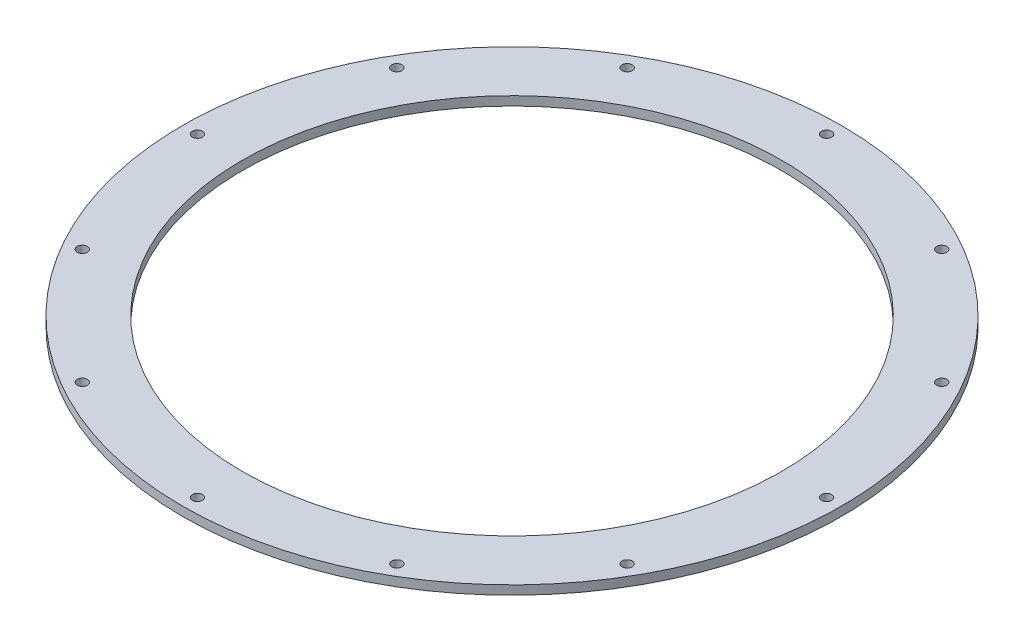
ISO-10303-21;
HEADER;
FILE_DESCRIPTION(('STEP AP214'),'2;1');
FILE_NAME('part.step','',(''),(''),'','','');
FILE_SCHEMA(('AUTOMOTIVE_DESIGN { 1 0 10303 214 1 1 1 1 }'));
ENDSEC;
DATA;
#1=APPLICATION_CONTEXT('core data for automotive mechanical design processes');
#2=APPLICATION_PROTOCOL_DEFINITION('international standard','automotive_design',2000,#1);
#3=PRODUCT_CONTEXT('',#1,'mechanical');
#4=PRODUCT('Part','Part','',(#3));
#5=PRODUCT_RELATED_PRODUCT_CATEGORY('part','',(#4));
#6=PRODUCT_DEFINITION_FORMATION('','',#4);
#7=PRODUCT_DEFINITION_CONTEXT('part definition',#1,'design');
#8=PRODUCT_DEFINITION('design','',#6,#7);
#9=PRODUCT_DEFINITION_SHAPE('','',#8);
#10=(LENGTH_UNIT() NAMED_UNIT(*) SI_UNIT(.MILLI.,.METRE.));
#11=(NAMED_UNIT(*) PLANE_ANGLE_UNIT() SI_UNIT($,.RADIAN.));
#12=(NAMED_UNIT(*) SI_UNIT($,.STERADIAN.) SOLID_ANGLE_UNIT());
#13=UNCERTAINTY_MEASURE_WITH_UNIT(LENGTH_MEASURE(1.E-05),#10,'distance_accuracy_value','');
#14=(GEOMETRIC_REPRESENTATION_CONTEXT(3) GLOBAL_UNCERTAINTY_ASSIGNED_CONTEXT((#13)) GLOBAL_UNIT_ASSIGNED_CONTEXT((#10,
#11,#12)) REPRESENTATION_CONTEXT('',''));
#15=CARTESIAN_POINT('',(0.,0.,0.));
#16=DIRECTION('',(0.,0.,1.));
#17=DIRECTION('',(1.,0.,0.));
#18=AXIS2_PLACEMENT_3D('',#15,#16,#17);
#19=CARTESIAN_POINT('',(0.,3.,0.));
#20=DIRECTION('',(0.,-1.,0.));
#21=DIRECTION('',(0.,0.,-1.));
#22=AXIS2_PLACEMENT_3D('',#19,#20,#21);
#23=CYLINDRICAL_SURFACE('',#22,90.);
#24=CARTESIAN_POINT('',(0.,3.,0.));
#25=DIRECTION('',(0.,1.,0.));
#26=DIRECTION('',(0.,0.,1.));
#27=AXIS2_PLACEMENT_3D('',#24,#25,#26);
#28=CIRCLE('',#27,90.);
#29=CARTESIAN_POINT('',(0.,3.,90.));
#30=VERTEX_POINT('',#29);
#31=EDGE_CURVE('E41',#30,#30,#28,.T.);
#32=ORIENTED_EDGE('',*,*,#31,.T.);
#33=EDGE_LOOP('',(#32));
#34=FACE_BOUND('',#33,.T.);
#35=CARTESIAN_POINT('',(0.,0.,0.));
#36=DIRECTION('',(0.,1.,0.));
#37=DIRECTION('',(0.,0.,1.));
#38=AXIS2_PLACEMENT_3D('',#35,#36,#37);
#39=CIRCLE('',#38,90.);
#40=CARTESIAN_POINT('',(0.,0.,90.));
#41=VERTEX_POINT('',#40);
#42=EDGE_CURVE('E85',#41,#41,#39,.T.);
#43=ORIENTED_EDGE('',*,*,#42,.F.);
#44=EDGE_LOOP('',(#43));
#45=FACE_BOUND('',#44,.T.);
#46=ADVANCED_FACE('F33',(#34,#45),#23,.F.);
#47=CARTESIAN_POINT('',(0.,3.,-105.));
#48=DIRECTION('',(0.,-1.,0.));
#49=DIRECTION('',(0.,0.,-1.));
#50=AXIS2_PLACEMENT_3D('',#47,#48,#49);
#51=CYLINDRICAL_SURFACE('',#50,1.70000000000001);
#52=CARTESIAN_POINT('',(0.,3.,-105.));
#53=DIRECTION('',(0.,1.,0.));
#54=DIRECTION('',(0.,0.,1.));
#55=AXIS2_PLACEMENT_3D('',#52,#53,#54);
#56=CIRCLE('',#55,1.70000000000001);
#57=CARTESIAN_POINT('',(0.,3.,-103.3));
#58=VERTEX_POINT('',#57);
#59=EDGE_CURVE('E46',#58,#58,#56,.T.);
#60=ORIENTED_EDGE('',*,*,#59,.T.);
#61=EDGE_LOOP('',(#60));
#62=FACE_BOUND('',#61,.T.);
#63=CARTESIAN_POINT('',(0.,0.,-105.));
#64=DIRECTION('',(0.,1.,0.));
#65=DIRECTION('',(0.,0.,1.));
#66=AXIS2_PLACEMENT_3D('',#63,#64,#65);
#67=CIRCLE('',#66,1.70000000000001);
#68=CARTESIAN_POINT('',(0.,0.,-103.3));
#69=VERTEX_POINT('',#68);
#70=EDGE_CURVE('E83',#69,#69,#67,.T.);
#71=ORIENTED_EDGE('',*,*,#70,.F.);
#72=EDGE_LOOP('',(#71));
#73=FACE_BOUND('',#72,.T.);
#74=ADVANCED_FACE('F130',(#62,#73),#51,.F.);
#75=CARTESIAN_POINT('',(52.5000000000005,3.,-90.9326673973678));
#76=DIRECTION('',(0.,-1.,0.));
#77=DIRECTION('',(0.,0.,-1.));
#78=AXIS2_PLACEMENT_3D('',#75,#76,#77);
#79=CYLINDRICAL_SURFACE('',#78,1.7);
#80=CARTESIAN_POINT('',(52.5000000000005,3.,-90.9326673973678));
#81=DIRECTION('',(0.,1.,0.));
#82=DIRECTION('',(0.,0.,1.));
#83=AXIS2_PLACEMENT_3D('',#80,#81,#82);
#84=CIRCLE('',#83,1.7);
#85=CARTESIAN_POINT('',(52.5000000000005,3.,-89.2326673973678));
#86=VERTEX_POINT('',#85);
#87=EDGE_CURVE('E125',#86,#86,#84,.T.);
#88=ORIENTED_EDGE('',*,*,#87,.T.);
#89=EDGE_LOOP('',(#88));
#90=FACE_BOUND('',#89,.T.);
#91=CARTESIAN_POINT('',(52.5000000000005,0.,-90.9326673973678));
#92=DIRECTION('',(0.,1.,0.));
#93=DIRECTION('',(0.,0.,1.));
#94=AXIS2_PLACEMENT_3D('',#91,#92,#93);
#95=CIRCLE('',#94,1.7);
#96=CARTESIAN_POINT('',(52.5000000000005,0.,-89.2326673973678));
#97=VERTEX_POINT('',#96);
#98=EDGE_CURVE('E80',#97,#97,#95,.T.);
#99=ORIENTED_EDGE('',*,*,#98,.F.);
#100=EDGE_LOOP('',(#99));
#101=FACE_BOUND('',#100,.T.);
#102=ADVANCED_FACE('F148',(#90,#101),#79,.F.);
#103=CARTESIAN_POINT('',(90.9326673973678,3.,-52.5000000000031));
#104=DIRECTION('',(0.,-1.,0.));
#105=DIRECTION('',(0.,0.,-1.));
#106=AXIS2_PLACEMENT_3D('',#103,#104,#105);
#107=CYLINDRICAL_SURFACE('',#106,1.7);
#108=CARTESIAN_POINT('',(90.9326673973678,3.,-52.5000000000031));
#109=DIRECTION('',(0.,1.,0.));
#110=DIRECTION('',(0.,0.,1.));
#111=AXIS2_PLACEMENT_3D('',#108,#109,#110);
#112=CIRCLE('',#111,1.7);
#113=CARTESIAN_POINT('',(90.9326673973678,3.,-50.8000000000031));
#114=VERTEX_POINT('',#113);
#115=EDGE_CURVE('E122',#114,#114,#112,.T.);
#116=ORIENTED_EDGE('',*,*,#115,.T.);
#117=EDGE_LOOP('',(#116));
#118=FACE_BOUND('',#117,.T.);
#119=CARTESIAN_POINT('',(90.9326673973678,0.,-52.5000000000031));
#120=DIRECTION('',(0.,1.,0.));
#121=DIRECTION('',(0.,0.,1.));
#122=AXIS2_PLACEMENT_3D('',#119,#120,#121);
#123=CIRCLE('',#122,1.7);
#124=CARTESIAN_POINT('',(90.9326673973678,0.,-50.8000000000031));
#125=VERTEX_POINT('',#124);
#126=EDGE_CURVE('E77',#125,#125,#123,.T.);
#127=ORIENTED_EDGE('',*,*,#126,.F.);
#128=EDGE_LOOP('',(#127));
#129=FACE_BOUND('',#128,.T.);
#130=ADVANCED_FACE('F155',(#118,#129),#107,.F.);
#131=CARTESIAN_POINT('',(105.000000000004,3.,-3.60937835248653E-12));
#132=DIRECTION('',(0.,-1.,0.));
#133=DIRECTION('',(0.,0.,-1.));
#134=AXIS2_PLACEMENT_3D('',#131,#132,#133);
#135=CYLINDRICAL_SURFACE('',#134,1.7);
#136=CARTESIAN_POINT('',(105.000000000004,3.,-3.60937835248653E-12));
#137=DIRECTION('',(0.,1.,0.));
#138=DIRECTION('',(0.,0.,1.));
#139=AXIS2_PLACEMENT_3D('',#136,#137,#138);
#140=CIRCLE('',#139,1.7);
#141=CARTESIAN_POINT('',(105.000000000004,3.,1.69999999999639));
#142=VERTEX_POINT('',#141);
#143=EDGE_CURVE('E119',#142,#142,#140,.T.);
#144=ORIENTED_EDGE('',*,*,#143,.T.);
#145=EDGE_LOOP('',(#144));
#146=FACE_BOUND('',#145,.T.);
#147=CARTESIAN_POINT('',(105.000000000004,0.,-3.60937835248653E-12));
#148=DIRECTION('',(0.,1.,0.));
#149=DIRECTION('',(0.,0.,1.));
#150=AXIS2_PLACEMENT_3D('',#147,#148,#149);
#151=CIRCLE('',#150,1.7);
#152=CARTESIAN_POINT('',(105.000000000004,0.,1.69999999999639));
#153=VERTEX_POINT('',#152);
#154=EDGE_CURVE('E74',#153,#153,#151,.T.);
#155=ORIENTED_EDGE('',*,*,#154,.F.);
#156=EDGE_LOOP('',(#155));
#157=FACE_BOUND('',#156,.T.);
#158=ADVANCED_FACE('F159',(#146,#157),#135,.F.);
#159=CARTESIAN_POINT('',(90.9326673973715,3.,52.4999999999969));
#160=DIRECTION('',(0.,-1.,0.));
#161=DIRECTION('',(0.,0.,-1.));
#162=AXIS2_PLACEMENT_3D('',#159,#160,#161);
#163=CYLINDRICAL_SURFACE('',#162,1.7);
#164=CARTESIAN_POINT('',(90.9326673973715,3.,52.4999999999969));
#165=DIRECTION('',(0.,1.,0.));
#166=DIRECTION('',(0.,0.,1.));
#167=AXIS2_PLACEMENT_3D('',#164,#165,#166);
#168=CIRCLE('',#167,1.7);
#169=CARTESIAN_POINT('',(90.9326673973715,3.,54.1999999999969));
#170=VERTEX_POINT('',#169);
#171=EDGE_CURVE('E116',#170,#170,#168,.T.);
#172=ORIENTED_EDGE('',*,*,#171,.T.);
#173=EDGE_LOOP('',(#172));
#174=FACE_BOUND('',#173,.T.);
#175=CARTESIAN_POINT('',(90.9326673973715,0.,52.4999999999969));
#176=DIRECTION('',(0.,1.,0.));
#177=DIRECTION('',(0.,0.,1.));
#178=AXIS2_PLACEMENT_3D('',#175,#176,#177);
#179=CIRCLE('',#178,1.7);
#180=CARTESIAN_POINT('',(90.9326673973715,0.,54.1999999999969));
#181=VERTEX_POINT('',#180);
#182=EDGE_CURVE('E71',#181,#181,#179,.T.);
#183=ORIENTED_EDGE('',*,*,#182,.F.);
#184=EDGE_LOOP('',(#183));
#185=FACE_BOUND('',#184,.T.);
#186=ADVANCED_FACE('F163',(#174,#185),#163,.F.);
#187=CARTESIAN_POINT('',(52.5000000000068,3.,90.9326673973642));
#188=DIRECTION('',(0.,-1.,0.));
#189=DIRECTION('',(0.,0.,-1.));
#190=AXIS2_PLACEMENT_3D('',#187,#188,#189);
#191=CYLINDRICAL_SURFACE('',#190,1.7);
#192=CARTESIAN_POINT('',(52.5000000000068,3.,90.9326673973642));
#193=DIRECTION('',(0.,1.,0.));
#194=DIRECTION('',(0.,0.,1.));
#195=AXIS2_PLACEMENT_3D('',#192,#193,#194);
#196=CIRCLE('',#195,1.7);
#197=CARTESIAN_POINT('',(52.5000000000068,3.,92.6326673973643));
#198=VERTEX_POINT('',#197);
#199=EDGE_CURVE('E113',#198,#198,#196,.T.);
#200=ORIENTED_EDGE('',*,*,#199,.T.);
#201=EDGE_LOOP('',(#200));
#202=FACE_BOUND('',#201,.T.);
#203=CARTESIAN_POINT('',(52.5000000000068,0.,90.9326673973642));
#204=DIRECTION('',(0.,1.,0.));
#205=DIRECTION('',(0.,0.,1.));
#206=AXIS2_PLACEMENT_3D('',#203,#204,#205);
#207=CIRCLE('',#206,1.7);
#208=CARTESIAN_POINT('',(52.5000000000068,0.,92.6326673973643));
#209=VERTEX_POINT('',#208);
#210=EDGE_CURVE('E68',#209,#209,#207,.T.);
#211=ORIENTED_EDGE('',*,*,#210,.F.);
#212=EDGE_LOOP('',(#211));
#213=FACE_BOUND('',#212,.T.);
#214=ADVANCED_FACE('F167',(#202,#213),#191,.F.);
#215=CARTESIAN_POINT('',(7.21875670497306E-12,3.,105.));
#216=DIRECTION('',(0.,-1.,0.));
#217=DIRECTION('',(0.,0.,-1.));
#218=AXIS2_PLACEMENT_3D('',#215,#216,#217);
#219=CYLINDRICAL_SURFACE('',#218,1.69999999999999);
#220=CARTESIAN_POINT('',(7.21875670497306E-12,3.,105.));
#221=DIRECTION('',(0.,1.,0.));
#222=DIRECTION('',(0.,0.,1.));
#223=AXIS2_PLACEMENT_3D('',#220,#221,#222);
#224=CIRCLE('',#223,1.69999999999999);
#225=CARTESIAN_POINT('',(7.21875670497306E-12,3.,106.7));
#226=VERTEX_POINT('',#225);
#227=EDGE_CURVE('E110',#226,#226,#224,.T.);
#228=ORIENTED_EDGE('',*,*,#227,.T.);
#229=EDGE_LOOP('',(#228));
#230=FACE_BOUND('',#229,.T.);
#231=CARTESIAN_POINT('',(7.21875670497306E-12,0.,105.));
#232=DIRECTION('',(0.,1.,0.));
#233=DIRECTION('',(0.,0.,1.));
#234=AXIS2_PLACEMENT_3D('',#231,#232,#233);
#235=CIRCLE('',#234,1.69999999999999);
#236=CARTESIAN_POINT('',(7.21875670497306E-12,0.,106.7));
#237=VERTEX_POINT('',#236);
#238=EDGE_CURVE('E65',#237,#237,#235,.T.);
#239=ORIENTED_EDGE('',*,*,#238,.F.);
#240=EDGE_LOOP('',(#239));
#241=FACE_BOUND('',#240,.T.);
#242=ADVANCED_FACE('F171',(#230,#241),#219,.F.);
#243=CARTESIAN_POINT('',(-52.4999999999932,3.,90.9326673973679));
#244=DIRECTION('',(0.,-1.,0.));
#245=DIRECTION('',(0.,0.,-1.));
#246=AXIS2_PLACEMENT_3D('',#243,#244,#245);
#247=CYLINDRICAL_SURFACE('',#246,1.7);
#248=CARTESIAN_POINT('',(-52.4999999999932,3.,90.9326673973679));
#249=DIRECTION('',(0.,1.,0.));
#250=DIRECTION('',(0.,0.,1.));
#251=AXIS2_PLACEMENT_3D('',#248,#249,#250);
#252=CIRCLE('',#251,1.7);
#253=CARTESIAN_POINT('',(-52.4999999999932,3.,92.6326673973679));
#254=VERTEX_POINT('',#253);
#255=EDGE_CURVE('E107',#254,#254,#252,.T.);
#256=ORIENTED_EDGE('',*,*,#255,.T.);
#257=EDGE_LOOP('',(#256));
#258=FACE_BOUND('',#257,.T.);
#259=CARTESIAN_POINT('',(-52.4999999999932,0.,90.9326673973679));
#260=DIRECTION('',(0.,1.,0.));
#261=DIRECTION('',(0.,0.,1.));
#262=AXIS2_PLACEMENT_3D('',#259,#260,#261);
#263=CIRCLE('',#262,1.7);
#264=CARTESIAN_POINT('',(-52.4999999999932,0.,92.6326673973679));
#265=VERTEX_POINT('',#264);
#266=EDGE_CURVE('E62',#265,#265,#263,.T.);
#267=ORIENTED_EDGE('',*,*,#266,.F.);
#268=EDGE_LOOP('',(#267));
#269=FACE_BOUND('',#268,.T.);
#270=ADVANCED_FACE('F175',(#258,#269),#247,.F.);
#271=CARTESIAN_POINT('',(-90.9326673973606,3.,52.5000000000032));
#272=DIRECTION('',(0.,-1.,0.));
#273=DIRECTION('',(0.,0.,-1.));
#274=AXIS2_PLACEMENT_3D('',#271,#272,#273);
#275=CYLINDRICAL_SURFACE('',#274,1.7);
#276=CARTESIAN_POINT('',(-90.9326673973606,3.,52.5000000000032));
#277=DIRECTION('',(0.,1.,0.));
#278=DIRECTION('',(0.,0.,1.));
#279=AXIS2_PLACEMENT_3D('',#276,#277,#278);
#280=CIRCLE('',#279,1.7);
#281=CARTESIAN_POINT('',(-90.9326673973606,3.,54.2000000000032));
#282=VERTEX_POINT('',#281);
#283=EDGE_CURVE('E104',#282,#282,#280,.T.);
#284=ORIENTED_EDGE('',*,*,#283,.T.);
#285=EDGE_LOOP('',(#284));
#286=FACE_BOUND('',#285,.T.);
#287=CARTESIAN_POINT('',(-90.9326673973606,0.,52.5000000000032));
#288=DIRECTION('',(0.,1.,0.));
#289=DIRECTION('',(0.,0.,1.));
#290=AXIS2_PLACEMENT_3D('',#287,#288,#289);
#291=CIRCLE('',#290,1.7);
#292=CARTESIAN_POINT('',(-90.9326673973606,0.,54.2000000000032));
#293=VERTEX_POINT('',#292);
#294=EDGE_CURVE('E59',#293,#293,#291,.T.);
#295=ORIENTED_EDGE('',*,*,#294,.F.);
#296=EDGE_LOOP('',(#295));
#297=FACE_BOUND('',#296,.T.);
#298=ADVANCED_FACE('F179',(#286,#297),#275,.F.);
#299=CARTESIAN_POINT('',(-104.999999999996,3.,3.62223714387758E-12));
#300=DIRECTION('',(0.,-1.,0.));
#301=DIRECTION('',(0.,0.,-1.));
#302=AXIS2_PLACEMENT_3D('',#299,#300,#301);
#303=CYLINDRICAL_SURFACE('',#302,1.7);
#304=CARTESIAN_POINT('',(-104.999999999996,3.,3.62223714387758E-12));
#305=DIRECTION('',(0.,1.,0.));
#306=DIRECTION('',(0.,0.,1.));
#307=AXIS2_PLACEMENT_3D('',#304,#305,#306);
#308=CIRCLE('',#307,1.7);
#309=CARTESIAN_POINT('',(-104.999999999996,3.,1.70000000000362));
#310=VERTEX_POINT('',#309);
#311=EDGE_CURVE('E99',#310,#310,#308,.T.);
#312=ORIENTED_EDGE('',*,*,#311,.T.);
#313=EDGE_LOOP('',(#312));
#314=FACE_BOUND('',#313,.T.);
#315=CARTESIAN_POINT('',(-104.999999999996,0.,3.62223714387758E-12));
#316=DIRECTION('',(0.,1.,0.));
#317=DIRECTION('',(0.,0.,1.));
#318=AXIS2_PLACEMENT_3D('',#315,#316,#317);
#319=CIRCLE('',#318,1.7);
#320=CARTESIAN_POINT('',(-104.999999999996,0.,1.70000000000362));
#321=VERTEX_POINT('',#320);
#322=EDGE_CURVE('E56',#321,#321,#319,.T.);
#323=ORIENTED_EDGE('',*,*,#322,.F.);
#324=EDGE_LOOP('',(#323));
#325=FACE_BOUND('',#324,.T.);
#326=ADVANCED_FACE('F183',(#314,#325),#303,.F.);
#327=CARTESIAN_POINT('',(-90.9326673973643,3.,-52.4999999999968));
#328=DIRECTION('',(0.,-1.,0.));
#329=DIRECTION('',(0.,0.,-1.));
#330=AXIS2_PLACEMENT_3D('',#327,#328,#329);
#331=CYLINDRICAL_SURFACE('',#330,1.7);
#332=CARTESIAN_POINT('',(-90.9326673973643,3.,-52.4999999999968));
#333=DIRECTION('',(0.,1.,0.));
#334=DIRECTION('',(0.,0.,1.));
#335=AXIS2_PLACEMENT_3D('',#332,#333,#334);
#336=CIRCLE('',#335,1.7);
#337=CARTESIAN_POINT('',(-90.9326673973643,3.,-50.7999999999968));
#338=VERTEX_POINT('',#337);
#339=EDGE_CURVE('E94',#338,#338,#336,.T.);
#340=ORIENTED_EDGE('',*,*,#339,.T.);
#341=EDGE_LOOP('',(#340));
#342=FACE_BOUND('',#341,.T.);
#343=CARTESIAN_POINT('',(-90.9326673973643,0.,-52.4999999999968));
#344=DIRECTION('',(0.,1.,0.));
#345=DIRECTION('',(0.,0.,1.));
#346=AXIS2_PLACEMENT_3D('',#343,#344,#345);
#347=CIRCLE('',#346,1.7);
#348=CARTESIAN_POINT('',(-90.9326673973643,0.,-50.7999999999968));
#349=VERTEX_POINT('',#348);
#350=EDGE_CURVE('E53',#349,#349,#347,.T.);
#351=ORIENTED_EDGE('',*,*,#350,.F.);
#352=EDGE_LOOP('',(#351));
#353=FACE_BOUND('',#352,.T.);
#354=ADVANCED_FACE('F186',(#342,#353),#331,.F.);
#355=CARTESIAN_POINT('',(-52.4999999999996,3.,-90.9326673973642));
#356=DIRECTION('',(0.,-1.,0.));
#357=DIRECTION('',(0.,0.,-1.));
#358=AXIS2_PLACEMENT_3D('',#355,#356,#357);
#359=CYLINDRICAL_SURFACE('',#358,1.7);
#360=CARTESIAN_POINT('',(-52.4999999999996,3.,-90.9326673973642));
#361=DIRECTION('',(0.,1.,0.));
#362=DIRECTION('',(0.,0.,1.));
#363=AXIS2_PLACEMENT_3D('',#360,#361,#362);
#364=CIRCLE('',#363,1.7);
#365=CARTESIAN_POINT('',(-52.4999999999996,3.,-89.2326673973642));
#366=VERTEX_POINT('',#365);
#367=EDGE_CURVE('E90',#366,#366,#364,.T.);
#368=ORIENTED_EDGE('',*,*,#367,.T.);
#369=EDGE_LOOP('',(#368));
#370=FACE_BOUND('',#369,.T.);
#371=CARTESIAN_POINT('',(-52.4999999999996,0.,-90.9326673973642));
#372=DIRECTION('',(0.,1.,0.));
#373=DIRECTION('',(0.,0.,1.));
#374=AXIS2_PLACEMENT_3D('',#371,#372,#373);
#375=CIRCLE('',#374,1.7);
#376=CARTESIAN_POINT('',(-52.4999999999996,0.,-89.2326673973642));
#377=VERTEX_POINT('',#376);
#378=EDGE_CURVE('E50',#377,#377,#375,.T.);
#379=ORIENTED_EDGE('',*,*,#378,.F.);
#380=EDGE_LOOP('',(#379));
#381=FACE_BOUND('',#380,.T.);
#382=ADVANCED_FACE('F35',(#370,#381),#359,.F.);
#383=CARTESIAN_POINT('',(0.,3.,0.));
#384=DIRECTION('',(0.,-1.,0.));
#385=DIRECTION('',(0.,0.,-1.));
#386=AXIS2_PLACEMENT_3D('',#383,#384,#385);
#387=CYLINDRICAL_SURFACE('',#386,110.);
#388=CARTESIAN_POINT('',(0.,3.,0.));
#389=DIRECTION('',(0.,1.,0.));
#390=DIRECTION('',(0.,0.,1.));
#391=AXIS2_PLACEMENT_3D('',#388,#389,#390);
#392=CIRCLE('',#391,110.);
#393=CARTESIAN_POINT('',(0.,3.,110.));
#394=VERTEX_POINT('',#393);
#395=EDGE_CURVE('E10',#394,#394,#392,.T.);
#396=ORIENTED_EDGE('',*,*,#395,.F.);
#397=EDGE_LOOP('',(#396));
#398=FACE_BOUND('',#397,.T.);
#399=CARTESIAN_POINT('',(0.,0.,0.));
#400=DIRECTION('',(0.,1.,0.));
#401=DIRECTION('',(0.,0.,1.));
#402=AXIS2_PLACEMENT_3D('',#399,#400,#401);
#403=CIRCLE('',#402,110.);
#404=CARTESIAN_POINT('',(0.,0.,110.));
#405=VERTEX_POINT('',#404);
#406=EDGE_CURVE('E37',#405,#405,#403,.T.);
#407=ORIENTED_EDGE('',*,*,#406,.T.);
#408=EDGE_LOOP('',(#407));
#409=FACE_BOUND('',#408,.T.);
#410=ADVANCED_FACE('F137',(#398,#409),#387,.T.);
#411=CARTESIAN_POINT('',(0.,3.,0.));
#412=DIRECTION('',(0.,1.,0.));
#413=DIRECTION('',(0.,0.,1.));
#414=AXIS2_PLACEMENT_3D('',#411,#412,#413);
#415=PLANE('',#414);
#416=ORIENTED_EDGE('',*,*,#367,.F.);
#417=EDGE_LOOP('',(#416));
#418=FACE_BOUND('',#417,.T.);
#419=ORIENTED_EDGE('',*,*,#339,.F.);
#420=EDGE_LOOP('',(#419));
#421=FACE_BOUND('',#420,.T.);
#422=ORIENTED_EDGE('',*,*,#311,.F.);
#423=EDGE_LOOP('',(#422));
#424=FACE_BOUND('',#423,.T.);
#425=ORIENTED_EDGE('',*,*,#283,.F.);
#426=EDGE_LOOP('',(#425));
#427=FACE_BOUND('',#426,.T.);
#428=ORIENTED_EDGE('',*,*,#255,.F.);
#429=EDGE_LOOP('',(#428));
#430=FACE_BOUND('',#429,.T.);
#431=ORIENTED_EDGE('',*,*,#227,.F.);
#432=EDGE_LOOP('',(#431));
#433=FACE_BOUND('',#432,.T.);
#434=ORIENTED_EDGE('',*,*,#199,.F.);
#435=EDGE_LOOP('',(#434));
#436=FACE_BOUND('',#435,.T.);
#437=ORIENTED_EDGE('',*,*,#171,.F.);
#438=EDGE_LOOP('',(#437));
#439=FACE_BOUND('',#438,.T.);
#440=ORIENTED_EDGE('',*,*,#143,.F.);
#441=EDGE_LOOP('',(#440));
#442=FACE_BOUND('',#441,.T.);
#443=ORIENTED_EDGE('',*,*,#115,.F.);
#444=EDGE_LOOP('',(#443));
#445=FACE_BOUND('',#444,.T.);
#446=ORIENTED_EDGE('',*,*,#87,.F.);
#447=EDGE_LOOP('',(#446));
#448=FACE_BOUND('',#447,.T.);
#449=ORIENTED_EDGE('',*,*,#59,.F.);
#450=EDGE_LOOP('',(#449));
#451=FACE_BOUND('',#450,.T.);
#452=ORIENTED_EDGE('',*,*,#31,.F.);
#453=EDGE_LOOP('',(#452));
#454=FACE_BOUND('',#453,.T.);
#455=ORIENTED_EDGE('',*,*,#395,.T.);
#456=EDGE_LOOP('',(#455));
#457=FACE_BOUND('',#456,.T.);
#458=ADVANCED_FACE('F133',(#418,#421,#424,#427,#430,#433,#436,#439,#442,#445,#448,#451,#454,
#457),#415,.T.);
#459=CARTESIAN_POINT('',(0.,0.,0.));
#460=DIRECTION('',(0.,1.,0.));
#461=DIRECTION('',(0.,0.,1.));
#462=AXIS2_PLACEMENT_3D('',#459,#460,#461);
#463=PLANE('',#462);
#464=ORIENTED_EDGE('',*,*,#378,.T.);
#465=EDGE_LOOP('',(#464));
#466=FACE_BOUND('',#465,.T.);
#467=ORIENTED_EDGE('',*,*,#350,.T.);
#468=EDGE_LOOP('',(#467));
#469=FACE_BOUND('',#468,.T.);
#470=ORIENTED_EDGE('',*,*,#322,.T.);
#471=EDGE_LOOP('',(#470));
#472=FACE_BOUND('',#471,.T.);
#473=ORIENTED_EDGE('',*,*,#294,.T.);
#474=EDGE_LOOP('',(#473));
#475=FACE_BOUND('',#474,.T.);
#476=ORIENTED_EDGE('',*,*,#266,.T.);
#477=EDGE_LOOP('',(#476));
#478=FACE_BOUND('',#477,.T.);
#479=ORIENTED_EDGE('',*,*,#238,.T.);
#480=EDGE_LOOP('',(#479));
#481=FACE_BOUND('',#480,.T.);
#482=ORIENTED_EDGE('',*,*,#210,.T.);
#483=EDGE_LOOP('',(#482));
#484=FACE_BOUND('',#483,.T.);
#485=ORIENTED_EDGE('',*,*,#182,.T.);
#486=EDGE_LOOP('',(#485));
#487=FACE_BOUND('',#486,.T.);
#488=ORIENTED_EDGE('',*,*,#154,.T.);
#489=EDGE_LOOP('',(#488));
#490=FACE_BOUND('',#489,.T.);
#491=ORIENTED_EDGE('',*,*,#126,.T.);
#492=EDGE_LOOP('',(#491));
#493=FACE_BOUND('',#492,.T.);
#494=ORIENTED_EDGE('',*,*,#98,.T.);
#495=EDGE_LOOP('',(#494));
#496=FACE_BOUND('',#495,.T.);
#497=ORIENTED_EDGE('',*,*,#70,.T.);
#498=EDGE_LOOP('',(#497));
#499=FACE_BOUND('',#498,.T.);
#500=ORIENTED_EDGE('',*,*,#42,.T.);
#501=EDGE_LOOP('',(#500));
#502=FACE_BOUND('',#501,.T.);
#503=ORIENTED_EDGE('',*,*,#406,.F.);
#504=EDGE_LOOP('',(#503));
#505=FACE_BOUND('',#504,.T.);
#506=ADVANCED_FACE('F136',(#466,#469,#472,#475,#478,#481,#484,#487,#490,#493,#496,#499,#502,
#505),#463,.F.);
#507=CLOSED_SHELL('',(#46,#74,#102,#130,#158,#186,#214,#242,#270,#298,#326,#354,#382,#410,#458,#506));
#508=MANIFOLD_SOLID_BREP('B2',#507);
#509=ADVANCED_BREP_SHAPE_REPRESENTATION('',(#18,#508),#14);
#510=SHAPE_DEFINITION_REPRESENTATION(#9,#509);
ENDSEC;
END-ISO-10303-21;
